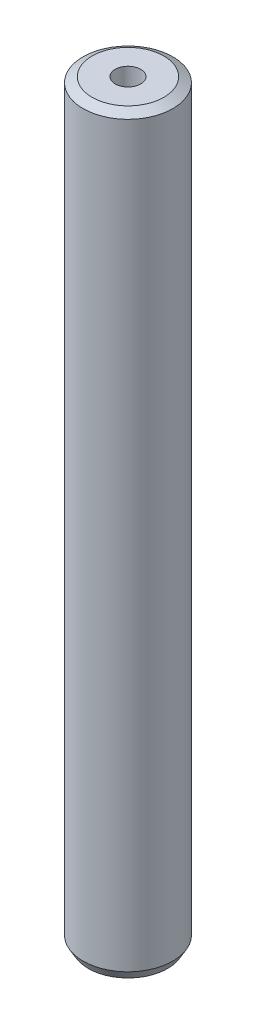
ISO-10303-21;
HEADER;
FILE_DESCRIPTION(('STEP AP214'),'2;1');
FILE_NAME('part.step','',(''),(''),'','','');
FILE_SCHEMA(('AUTOMOTIVE_DESIGN { 1 0 10303 214 1 1 1 1 }'));
ENDSEC;
DATA;
#1=APPLICATION_CONTEXT('core data for automotive mechanical design processes');
#2=APPLICATION_PROTOCOL_DEFINITION('international standard','automotive_design',2000,#1);
#3=PRODUCT_CONTEXT('',#1,'mechanical');
#4=PRODUCT('Part','Part','',(#3));
#5=PRODUCT_RELATED_PRODUCT_CATEGORY('part','',(#4));
#6=PRODUCT_DEFINITION_FORMATION('','',#4);
#7=PRODUCT_DEFINITION_CONTEXT('part definition',#1,'design');
#8=PRODUCT_DEFINITION('design','',#6,#7);
#9=PRODUCT_DEFINITION_SHAPE('','',#8);
#10=(LENGTH_UNIT() NAMED_UNIT(*) SI_UNIT(.MILLI.,.METRE.));
#11=(NAMED_UNIT(*) PLANE_ANGLE_UNIT() SI_UNIT($,.RADIAN.));
#12=(NAMED_UNIT(*) SI_UNIT($,.STERADIAN.) SOLID_ANGLE_UNIT());
#13=UNCERTAINTY_MEASURE_WITH_UNIT(LENGTH_MEASURE(1.E-05),#10,'distance_accuracy_value','');
#14=(GEOMETRIC_REPRESENTATION_CONTEXT(3) GLOBAL_UNCERTAINTY_ASSIGNED_CONTEXT((#13)) GLOBAL_UNIT_ASSIGNED_CONTEXT((#10,
#11,#12)) REPRESENTATION_CONTEXT('',''));
#15=CARTESIAN_POINT('',(0.,0.,0.));
#16=DIRECTION('',(0.,0.,1.));
#17=DIRECTION('',(1.,0.,0.));
#18=AXIS2_PLACEMENT_3D('',#15,#16,#17);
#19=CARTESIAN_POINT('',(0.,83.7847235493783,0.));
#20=DIRECTION('',(0.,-1.,0.));
#21=DIRECTION('',(0.,0.,-1.));
#22=AXIS2_PLACEMENT_3D('',#19,#20,#21);
#23=CYLINDRICAL_SURFACE('',#22,5.);
#24=CARTESIAN_POINT('',(0.,83.2027194546696,0.));
#25=DIRECTION('',(0.,1.,0.));
#26=DIRECTION('',(0.,0.,1.));
#27=AXIS2_PLACEMENT_3D('',#24,#25,#26);
#28=CIRCLE('',#27,5.);
#29=CARTESIAN_POINT('',(0.,83.2027194546696,5.));
#30=VERTEX_POINT('',#29);
#31=EDGE_CURVE('E50',#30,#30,#28,.F.);
#32=ORIENTED_EDGE('',*,*,#31,.T.);
#33=EDGE_LOOP('',(#32));
#34=FACE_BOUND('',#33,.T.);
#35=CARTESIAN_POINT('',(0.,1.0080606622485,0.));
#36=DIRECTION('',(0.,1.,0.));
#37=DIRECTION('',(0.,0.,1.));
#38=AXIS2_PLACEMENT_3D('',#35,#36,#37);
#39=CIRCLE('',#38,5.);
#40=CARTESIAN_POINT('',(0.,1.0080606622485,5.));
#41=VERTEX_POINT('',#40);
#42=EDGE_CURVE('E51',#41,#41,#39,.T.);
#43=ORIENTED_EDGE('',*,*,#42,.T.);
#44=EDGE_LOOP('',(#43));
#45=FACE_BOUND('',#44,.T.);
#46=ADVANCED_FACE('F39',(#34,#45),#23,.T.);
#47=CARTESIAN_POINT('',(0.,83.7847235493783,0.));
#48=DIRECTION('',(0.,1.,0.));
#49=DIRECTION('',(0.,0.,1.));
#50=AXIS2_PLACEMENT_3D('',#47,#48,#49);
#51=PLANE('',#50);
#52=CARTESIAN_POINT('',(0.,83.7847235493783,0.));
#53=DIRECTION('',(0.,1.,0.));
#54=DIRECTION('',(0.,0.,1.));
#55=AXIS2_PLACEMENT_3D('',#52,#53,#54);
#56=CIRCLE('',#55,3.99193933775145);
#57=CARTESIAN_POINT('',(0.,83.7847235493783,3.99193933775145));
#58=VERTEX_POINT('',#57);
#59=EDGE_CURVE('E54',#58,#58,#56,.T.);
#60=ORIENTED_EDGE('',*,*,#59,.T.);
#61=EDGE_LOOP('',(#60));
#62=FACE_BOUND('',#61,.T.);
#63=CARTESIAN_POINT('',(0.,83.7847235493783,0.));
#64=DIRECTION('',(0.,1.,0.));
#65=DIRECTION('',(0.,0.,1.));
#66=AXIS2_PLACEMENT_3D('',#63,#64,#65);
#67=CIRCLE('',#66,1.41982599995286);
#68=CARTESIAN_POINT('',(0.,83.7847235493783,1.41982599995286));
#69=VERTEX_POINT('',#68);
#70=EDGE_CURVE('E58',#69,#69,#67,.T.);
#71=ORIENTED_EDGE('',*,*,#70,.F.);
#72=EDGE_LOOP('',(#71));
#73=FACE_BOUND('',#72,.T.);
#74=ADVANCED_FACE('F69',(#62,#73),#51,.T.);
#75=CARTESIAN_POINT('',(0.,0.,0.));
#76=DIRECTION('',(0.,1.,0.));
#77=DIRECTION('',(0.,0.,1.));
#78=AXIS2_PLACEMENT_3D('',#75,#76,#77);
#79=PLANE('',#78);
#80=CARTESIAN_POINT('',(0.,0.,0.));
#81=DIRECTION('',(0.,1.,0.));
#82=DIRECTION('',(0.,0.,1.));
#83=AXIS2_PLACEMENT_3D('',#80,#81,#82);
#84=CIRCLE('',#83,4.41799590529136);
#85=CARTESIAN_POINT('',(0.,0.,4.41799590529136));
#86=VERTEX_POINT('',#85);
#87=EDGE_CURVE('E10',#86,#86,#84,.F.);
#88=ORIENTED_EDGE('',*,*,#87,.T.);
#89=EDGE_LOOP('',(#88));
#90=FACE_BOUND('',#89,.T.);
#91=CARTESIAN_POINT('',(0.,0.,0.));
#92=DIRECTION('',(0.,1.,0.));
#93=DIRECTION('',(0.,0.,1.));
#94=AXIS2_PLACEMENT_3D('',#91,#92,#93);
#95=CIRCLE('',#94,1.41982599995286);
#96=CARTESIAN_POINT('',(0.,0.,1.41982599995286));
#97=VERTEX_POINT('',#96);
#98=EDGE_CURVE('E63',#97,#97,#95,.T.);
#99=ORIENTED_EDGE('',*,*,#98,.T.);
#100=EDGE_LOOP('',(#99));
#101=FACE_BOUND('',#100,.T.);
#102=ADVANCED_FACE('F75',(#90,#101),#79,.F.);
#103=CARTESIAN_POINT('',(0.,83.7847235493783,0.));
#104=DIRECTION('',(0.,-1.,0.));
#105=DIRECTION('',(0.,0.,-1.));
#106=AXIS2_PLACEMENT_3D('',#103,#104,#105);
#107=CYLINDRICAL_SURFACE('',#106,1.41982599995286);
#108=ORIENTED_EDGE('',*,*,#70,.T.);
#109=EDGE_LOOP('',(#108));
#110=FACE_BOUND('',#109,.T.);
#111=ORIENTED_EDGE('',*,*,#98,.F.);
#112=EDGE_LOOP('',(#111));
#113=FACE_BOUND('',#112,.T.);
#114=ADVANCED_FACE('F70',(#110,#113),#107,.F.);
#115=CARTESIAN_POINT('',(0.,83.7847235493783,0.));
#116=DIRECTION('',(0.,-1.,0.));
#117=DIRECTION('',(0.,0.,-1.));
#118=AXIS2_PLACEMENT_3D('',#115,#116,#117);
#119=CONICAL_SURFACE('',#118,3.99193933775145,1.0471975511966);
#120=ORIENTED_EDGE('',*,*,#31,.F.);
#121=EDGE_LOOP('',(#120));
#122=FACE_BOUND('',#121,.T.);
#123=ORIENTED_EDGE('',*,*,#59,.F.);
#124=EDGE_LOOP('',(#123));
#125=FACE_BOUND('',#124,.T.);
#126=ADVANCED_FACE('F81',(#122,#125),#119,.T.);
#127=CARTESIAN_POINT('',(0.,1.0080606622485,0.));
#128=DIRECTION('',(0.,1.,0.));
#129=DIRECTION('',(0.,0.,1.));
#130=AXIS2_PLACEMENT_3D('',#127,#128,#129);
#131=CONICAL_SURFACE('',#130,5.,0.5235987755983);
#132=ORIENTED_EDGE('',*,*,#87,.F.);
#133=EDGE_LOOP('',(#132));
#134=FACE_BOUND('',#133,.T.);
#135=ORIENTED_EDGE('',*,*,#42,.F.);
#136=EDGE_LOOP('',(#135));
#137=FACE_BOUND('',#136,.T.);
#138=ADVANCED_FACE('F45',(#134,#137),#131,.T.);
#139=CLOSED_SHELL('',(#46,#74,#102,#114,#126,#138));
#140=MANIFOLD_SOLID_BREP('B2',#139);
#141=ADVANCED_BREP_SHAPE_REPRESENTATION('',(#18,#140),#14);
#142=SHAPE_DEFINITION_REPRESENTATION(#9,#141);
ENDSEC;
END-ISO-10303-21;
